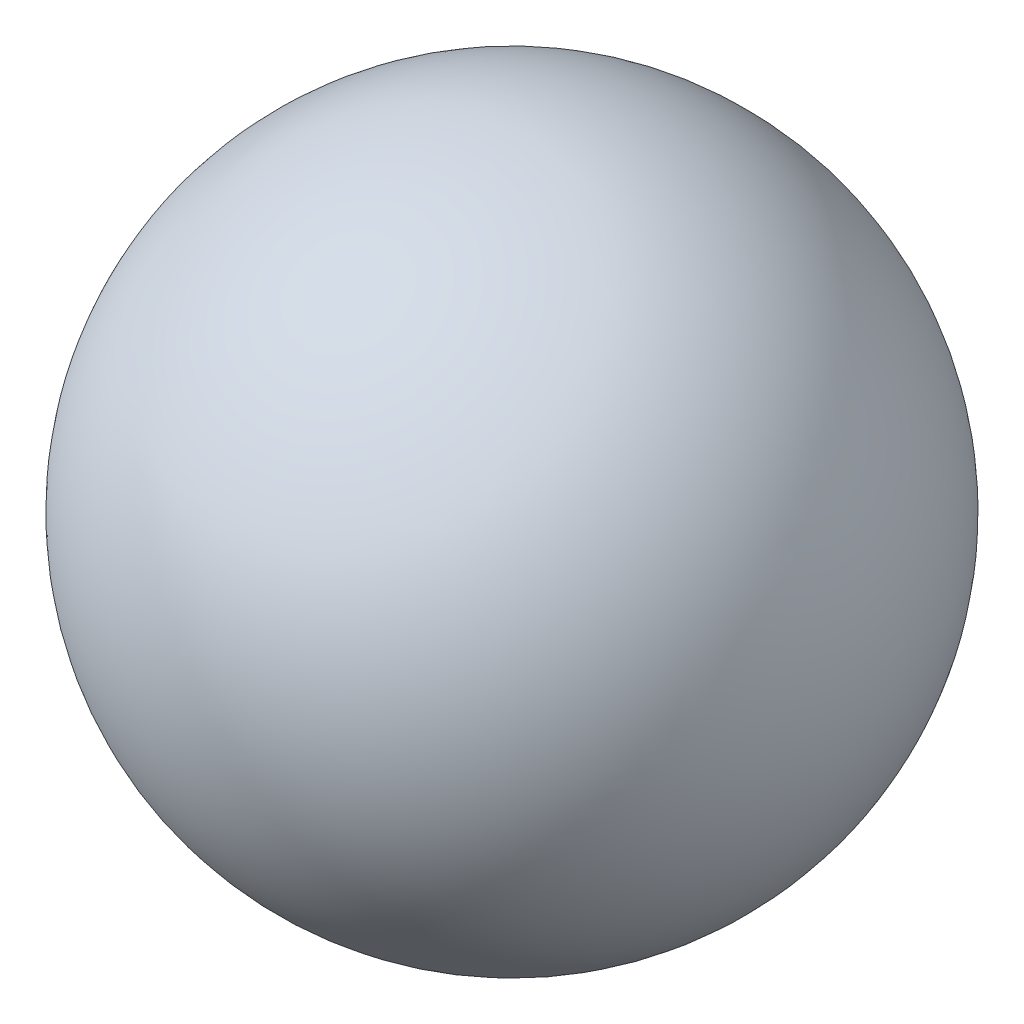
ISO-10303-21;
HEADER;
FILE_DESCRIPTION(('STEP AP214'),'2;1');
FILE_NAME('part.step','',(''),(''),'','','');
FILE_SCHEMA(('AUTOMOTIVE_DESIGN { 1 0 10303 214 1 1 1 1 }'));
ENDSEC;
DATA;
#1=APPLICATION_CONTEXT('core data for automotive mechanical design processes');
#2=APPLICATION_PROTOCOL_DEFINITION('international standard','automotive_design',2000,#1);
#3=PRODUCT_CONTEXT('',#1,'mechanical');
#4=PRODUCT('Part','Part','',(#3));
#5=PRODUCT_RELATED_PRODUCT_CATEGORY('part','',(#4));
#6=PRODUCT_DEFINITION_FORMATION('','',#4);
#7=PRODUCT_DEFINITION_CONTEXT('part definition',#1,'design');
#8=PRODUCT_DEFINITION('design','',#6,#7);
#9=PRODUCT_DEFINITION_SHAPE('','',#8);
#10=(LENGTH_UNIT() NAMED_UNIT(*) SI_UNIT(.MILLI.,.METRE.));
#11=(NAMED_UNIT(*) PLANE_ANGLE_UNIT() SI_UNIT($,.RADIAN.));
#12=(NAMED_UNIT(*) SI_UNIT($,.STERADIAN.) SOLID_ANGLE_UNIT());
#13=UNCERTAINTY_MEASURE_WITH_UNIT(LENGTH_MEASURE(1.E-05),#10,'distance_accuracy_value','');
#14=(GEOMETRIC_REPRESENTATION_CONTEXT(3) GLOBAL_UNCERTAINTY_ASSIGNED_CONTEXT((#13)) GLOBAL_UNIT_ASSIGNED_CONTEXT((#10,
#11,#12)) REPRESENTATION_CONTEXT('',''));
#15=CARTESIAN_POINT('',(0.,0.,0.));
#16=DIRECTION('',(0.,0.,1.));
#17=DIRECTION('',(1.,0.,0.));
#18=AXIS2_PLACEMENT_3D('',#15,#16,#17);
#19=CARTESIAN_POINT('',(0.,0.,0.));
#20=DIRECTION('',(-1.,0.,0.));
#21=DIRECTION('',(0.,1.,0.));
#22=AXIS2_PLACEMENT_3D('',#19,#20,#21);
#23=SPHERICAL_SURFACE('',#22,0.45);
#24=CARTESIAN_POINT('',(-0.45,0.,0.));
#25=VERTEX_POINT('',#24);
#26=VERTEX_LOOP('',#25);
#27=FACE_BOUND('',#26,.T.);
#28=ADVANCED_FACE('F27',(#27),#23,.T.);
#29=CLOSED_SHELL('',(#28));
#30=MANIFOLD_SOLID_BREP('B2',#29);
#31=ADVANCED_BREP_SHAPE_REPRESENTATION('',(#18,#30),#14);
#32=SHAPE_DEFINITION_REPRESENTATION(#9,#31);
ENDSEC;
END-ISO-10303-21;
